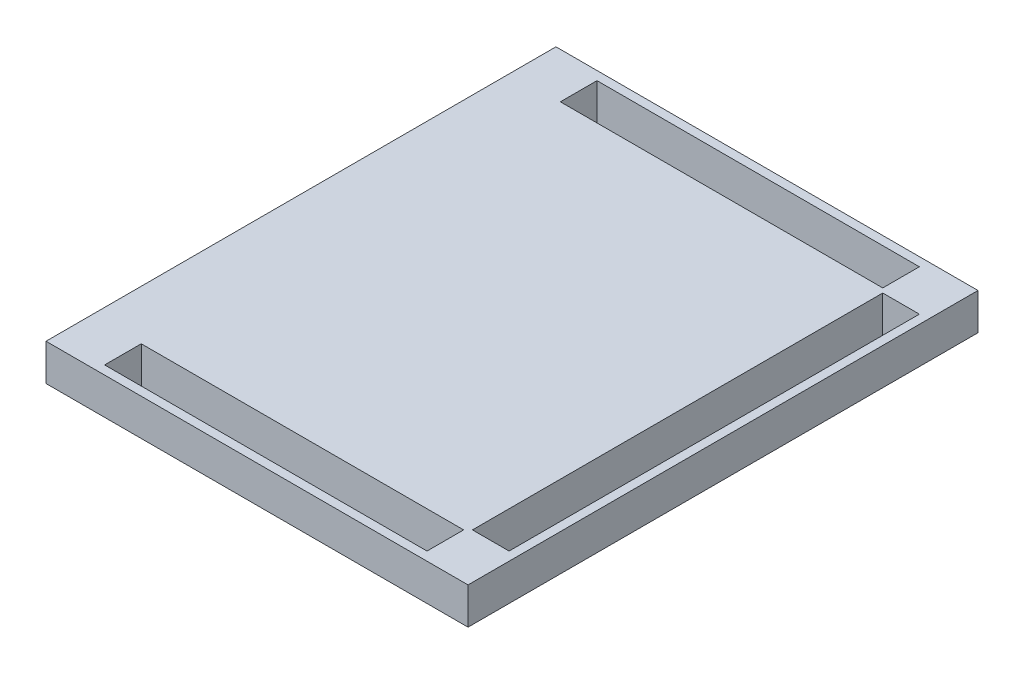
ISO-10303-21;
HEADER;
FILE_DESCRIPTION(('STEP AP214'),'2;1');
FILE_NAME('part.step','',(''),(''),'','','');
FILE_SCHEMA(('AUTOMOTIVE_DESIGN { 1 0 10303 214 1 1 1 1 }'));
ENDSEC;
DATA;
#1=APPLICATION_CONTEXT('core data for automotive mechanical design processes');
#2=APPLICATION_PROTOCOL_DEFINITION('international standard','automotive_design',2000,#1);
#3=PRODUCT_CONTEXT('',#1,'mechanical');
#4=PRODUCT('Part','Part','',(#3));
#5=PRODUCT_RELATED_PRODUCT_CATEGORY('part','',(#4));
#6=PRODUCT_DEFINITION_FORMATION('','',#4);
#7=PRODUCT_DEFINITION_CONTEXT('part definition',#1,'design');
#8=PRODUCT_DEFINITION('design','',#6,#7);
#9=PRODUCT_DEFINITION_SHAPE('','',#8);
#10=(LENGTH_UNIT() NAMED_UNIT(*) SI_UNIT(.MILLI.,.METRE.));
#11=(NAMED_UNIT(*) PLANE_ANGLE_UNIT() SI_UNIT($,.RADIAN.));
#12=(NAMED_UNIT(*) SI_UNIT($,.STERADIAN.) SOLID_ANGLE_UNIT());
#13=UNCERTAINTY_MEASURE_WITH_UNIT(LENGTH_MEASURE(1.E-05),#10,'distance_accuracy_value','');
#14=(GEOMETRIC_REPRESENTATION_CONTEXT(3) GLOBAL_UNCERTAINTY_ASSIGNED_CONTEXT((#13)) GLOBAL_UNIT_ASSIGNED_CONTEXT((#10,
#11,#12)) REPRESENTATION_CONTEXT('',''));
#15=CARTESIAN_POINT('',(0.,0.,0.));
#16=DIRECTION('',(0.,0.,1.));
#17=DIRECTION('',(1.,0.,0.));
#18=AXIS2_PLACEMENT_3D('',#15,#16,#17);
#19=CARTESIAN_POINT('',(0.,25.,0.));
#20=DIRECTION('',(0.,1.,0.));
#21=DIRECTION('',(0.,0.,1.));
#22=AXIS2_PLACEMENT_3D('',#19,#20,#21);
#23=PLANE('',#22);
#24=DIRECTION('',(0.,0.,1.));
#25=VECTOR('',#24,1.);
#26=CARTESIAN_POINT('',(-32.2226938585367,25.,-333.011164946951));
#27=LINE('',#26,#25);
#28=CARTESIAN_POINT('',(-32.2226938585367,25.,-333.011164946951));
#29=VERTEX_POINT('',#28);
#30=CARTESIAN_POINT('',(-32.2226938585366,25.,14.9888350530488));
#31=VERTEX_POINT('',#30);
#32=EDGE_CURVE('E289',#29,#31,#27,.T.);
#33=ORIENTED_EDGE('',*,*,#32,.T.);
#34=DIRECTION('',(1.,0.,0.));
#35=VECTOR('',#34,1.);
#36=CARTESIAN_POINT('',(-32.2226938585366,25.,14.9888350530488));
#37=LINE('',#36,#35);
#38=CARTESIAN_POINT('',(255.777306141463,25.,14.9888350530488));
#39=VERTEX_POINT('',#38);
#40=EDGE_CURVE('E293',#31,#39,#37,.T.);
#41=ORIENTED_EDGE('',*,*,#40,.T.);
#42=DIRECTION('',(0.,0.,-1.));
#43=VECTOR('',#42,1.);
#44=CARTESIAN_POINT('',(255.777306141463,25.,-333.011164946951));
#45=LINE('',#44,#43);
#46=CARTESIAN_POINT('',(255.777306141463,25.,-333.011164946951));
#47=VERTEX_POINT('',#46);
#48=EDGE_CURVE('E297',#39,#47,#45,.T.);
#49=ORIENTED_EDGE('',*,*,#48,.T.);
#50=DIRECTION('',(-1.,0.,0.));
#51=VECTOR('',#50,1.);
#52=CARTESIAN_POINT('',(-32.2226938585367,25.,-333.011164946951));
#53=LINE('',#52,#51);
#54=EDGE_CURVE('E300',#47,#29,#53,.T.);
#55=ORIENTED_EDGE('',*,*,#54,.T.);
#56=EDGE_LOOP('',(#33,#41,#49,#55));
#57=FACE_BOUND('',#56,.T.);
#58=DIRECTION('',(1.,0.,0.));
#59=VECTOR('',#58,1.);
#60=CARTESIAN_POINT('',(224.777306141463,25.,-19.0111649469512));
#61=LINE('',#60,#59);
#62=CARTESIAN_POINT('',(224.777306141463,25.,-19.0111649469512));
#63=VERTEX_POINT('',#62);
#64=CARTESIAN_POINT('',(249.777306141463,25.,-19.0111649469512));
#65=VERTEX_POINT('',#64);
#66=EDGE_CURVE('E250',#63,#65,#61,.T.);
#67=ORIENTED_EDGE('',*,*,#66,.F.);
#68=DIRECTION('',(0.,0.,1.));
#69=VECTOR('',#68,1.);
#70=CARTESIAN_POINT('',(224.777306141463,25.,-299.011164946951));
#71=LINE('',#70,#69);
#72=CARTESIAN_POINT('',(224.777306141463,25.,-299.011164946951));
#73=VERTEX_POINT('',#72);
#74=EDGE_CURVE('E247',#73,#63,#71,.T.);
#75=ORIENTED_EDGE('',*,*,#74,.F.);
#76=DIRECTION('',(-1.,0.,0.));
#77=VECTOR('',#76,1.);
#78=CARTESIAN_POINT('',(224.777306141463,25.,-299.011164946951));
#79=LINE('',#78,#77);
#80=CARTESIAN_POINT('',(249.777306141463,25.,-299.011164946951));
#81=VERTEX_POINT('',#80);
#82=EDGE_CURVE('E258',#81,#73,#79,.T.);
#83=ORIENTED_EDGE('',*,*,#82,.F.);
#84=DIRECTION('',(0.,0.,-1.));
#85=VECTOR('',#84,1.);
#86=CARTESIAN_POINT('',(249.777306141463,25.,-299.011164946951));
#87=LINE('',#86,#85);
#88=EDGE_CURVE('E254',#65,#81,#87,.T.);
#89=ORIENTED_EDGE('',*,*,#88,.F.);
#90=EDGE_LOOP('',(#67,#75,#83,#89));
#91=FACE_BOUND('',#90,.T.);
#92=DIRECTION('',(1.,0.,0.));
#93=VECTOR('',#92,1.);
#94=CARTESIAN_POINT('',(1.77730614146338,25.,8.98883505304879));
#95=LINE('',#94,#93);
#96=CARTESIAN_POINT('',(1.77730614146338,25.,8.98883505304879));
#97=VERTEX_POINT('',#96);
#98=CARTESIAN_POINT('',(221.777306141463,25.,8.98883505304879));
#99=VERTEX_POINT('',#98);
#100=EDGE_CURVE('E209',#97,#99,#95,.T.);
#101=ORIENTED_EDGE('',*,*,#100,.F.);
#102=DIRECTION('',(0.,0.,1.));
#103=VECTOR('',#102,1.);
#104=CARTESIAN_POINT('',(1.77730614146337,25.,-16.0111649469512));
#105=LINE('',#104,#103);
#106=CARTESIAN_POINT('',(1.77730614146337,25.,-16.0111649469512));
#107=VERTEX_POINT('',#106);
#108=EDGE_CURVE('E206',#107,#97,#105,.T.);
#109=ORIENTED_EDGE('',*,*,#108,.F.);
#110=DIRECTION('',(-1.,0.,0.));
#111=VECTOR('',#110,1.);
#112=CARTESIAN_POINT('',(1.77730614146337,25.,-16.0111649469512));
#113=LINE('',#112,#111);
#114=CARTESIAN_POINT('',(221.777306141463,25.,-16.0111649469512));
#115=VERTEX_POINT('',#114);
#116=EDGE_CURVE('E216',#115,#107,#113,.T.);
#117=ORIENTED_EDGE('',*,*,#116,.F.);
#118=DIRECTION('',(0.,0.,-1.));
#119=VECTOR('',#118,1.);
#120=CARTESIAN_POINT('',(221.777306141463,25.,-16.0111649469512));
#121=LINE('',#120,#119);
#122=EDGE_CURVE('E213',#99,#115,#121,.T.);
#123=ORIENTED_EDGE('',*,*,#122,.F.);
#124=EDGE_LOOP('',(#101,#109,#117,#123));
#125=FACE_BOUND('',#124,.T.);
#126=DIRECTION('',(1.,0.,0.));
#127=VECTOR('',#126,1.);
#128=CARTESIAN_POINT('',(1.77730614146338,25.,-302.011164946951));
#129=LINE('',#128,#127);
#130=CARTESIAN_POINT('',(1.77730614146338,25.,-302.011164946951));
#131=VERTEX_POINT('',#130);
#132=CARTESIAN_POINT('',(221.777306141463,25.,-302.011164946951));
#133=VERTEX_POINT('',#132);
#134=EDGE_CURVE('E165',#131,#133,#129,.T.);
#135=ORIENTED_EDGE('',*,*,#134,.F.);
#136=DIRECTION('',(0.,0.,1.));
#137=VECTOR('',#136,1.);
#138=CARTESIAN_POINT('',(1.77730614146338,25.,-327.011164946951));
#139=LINE('',#138,#137);
#140=CARTESIAN_POINT('',(1.77730614146338,25.,-327.011164946951));
#141=VERTEX_POINT('',#140);
#142=EDGE_CURVE('E154',#141,#131,#139,.T.);
#143=ORIENTED_EDGE('',*,*,#142,.F.);
#144=DIRECTION('',(-1.,0.,0.));
#145=VECTOR('',#144,1.);
#146=CARTESIAN_POINT('',(1.77730614146338,25.,-327.011164946951));
#147=LINE('',#146,#145);
#148=CARTESIAN_POINT('',(221.777306141463,25.,-327.011164946951));
#149=VERTEX_POINT('',#148);
#150=EDGE_CURVE('E182',#149,#141,#147,.T.);
#151=ORIENTED_EDGE('',*,*,#150,.F.);
#152=DIRECTION('',(0.,0.,-1.));
#153=VECTOR('',#152,1.);
#154=CARTESIAN_POINT('',(221.777306141463,25.,-327.011164946951));
#155=LINE('',#154,#153);
#156=EDGE_CURVE('E178',#133,#149,#155,.T.);
#157=ORIENTED_EDGE('',*,*,#156,.F.);
#158=EDGE_LOOP('',(#135,#143,#151,#157));
#159=FACE_BOUND('',#158,.T.);
#160=ADVANCED_FACE('F39',(#57,#91,#125,#159),#23,.T.);
#161=CARTESIAN_POINT('',(0.,0.,0.));
#162=DIRECTION('',(0.,1.,0.));
#163=DIRECTION('',(0.,0.,1.));
#164=AXIS2_PLACEMENT_3D('',#161,#162,#163);
#165=PLANE('',#164);
#166=DIRECTION('',(0.,0.,1.));
#167=VECTOR('',#166,1.);
#168=CARTESIAN_POINT('',(1.77730614146337,0.,-16.0111649469512));
#169=LINE('',#168,#167);
#170=CARTESIAN_POINT('',(1.77730614146337,0.,-16.0111649469512));
#171=VERTEX_POINT('',#170);
#172=CARTESIAN_POINT('',(1.77730614146338,0.,8.98883505304879));
#173=VERTEX_POINT('',#172);
#174=EDGE_CURVE('E220',#171,#173,#169,.T.);
#175=ORIENTED_EDGE('',*,*,#174,.T.);
#176=DIRECTION('',(1.,0.,0.));
#177=VECTOR('',#176,1.);
#178=CARTESIAN_POINT('',(1.77730614146338,0.,8.98883505304879));
#179=LINE('',#178,#177);
#180=CARTESIAN_POINT('',(221.777306141463,0.,8.98883505304879));
#181=VERTEX_POINT('',#180);
#182=EDGE_CURVE('E224',#173,#181,#179,.T.);
#183=ORIENTED_EDGE('',*,*,#182,.T.);
#184=DIRECTION('',(0.,0.,-1.));
#185=VECTOR('',#184,1.);
#186=CARTESIAN_POINT('',(221.777306141463,0.,-16.0111649469512));
#187=LINE('',#186,#185);
#188=CARTESIAN_POINT('',(221.777306141463,0.,-16.0111649469512));
#189=VERTEX_POINT('',#188);
#190=EDGE_CURVE('E229',#181,#189,#187,.T.);
#191=ORIENTED_EDGE('',*,*,#190,.T.);
#192=DIRECTION('',(-1.,0.,0.));
#193=VECTOR('',#192,1.);
#194=CARTESIAN_POINT('',(1.77730614146337,0.,-16.0111649469512));
#195=LINE('',#194,#193);
#196=EDGE_CURVE('E210',#189,#171,#195,.T.);
#197=ORIENTED_EDGE('',*,*,#196,.T.);
#198=EDGE_LOOP('',(#175,#183,#191,#197));
#199=FACE_BOUND('',#198,.T.);
#200=DIRECTION('',(0.,0.,1.));
#201=VECTOR('',#200,1.);
#202=CARTESIAN_POINT('',(-32.2226938585367,0.,-333.011164946951));
#203=LINE('',#202,#201);
#204=CARTESIAN_POINT('',(-32.2226938585367,0.,-333.011164946951));
#205=VERTEX_POINT('',#204);
#206=CARTESIAN_POINT('',(-32.2226938585366,0.,14.9888350530488));
#207=VERTEX_POINT('',#206);
#208=EDGE_CURVE('E174',#205,#207,#203,.T.);
#209=ORIENTED_EDGE('',*,*,#208,.F.);
#210=DIRECTION('',(-1.,0.,0.));
#211=VECTOR('',#210,1.);
#212=CARTESIAN_POINT('',(-32.2226938585367,0.,-333.011164946951));
#213=LINE('',#212,#211);
#214=CARTESIAN_POINT('',(255.777306141463,0.,-333.011164946951));
#215=VERTEX_POINT('',#214);
#216=EDGE_CURVE('E294',#215,#205,#213,.T.);
#217=ORIENTED_EDGE('',*,*,#216,.F.);
#218=DIRECTION('',(0.,0.,-1.));
#219=VECTOR('',#218,1.);
#220=CARTESIAN_POINT('',(255.777306141463,0.,-333.011164946951));
#221=LINE('',#220,#219);
#222=CARTESIAN_POINT('',(255.777306141463,0.,14.9888350530488));
#223=VERTEX_POINT('',#222);
#224=EDGE_CURVE('E310',#223,#215,#221,.T.);
#225=ORIENTED_EDGE('',*,*,#224,.F.);
#226=DIRECTION('',(1.,0.,0.));
#227=VECTOR('',#226,1.);
#228=CARTESIAN_POINT('',(-32.2226938585366,0.,14.9888350530488));
#229=LINE('',#228,#227);
#230=EDGE_CURVE('E307',#207,#223,#229,.T.);
#231=ORIENTED_EDGE('',*,*,#230,.F.);
#232=EDGE_LOOP('',(#209,#217,#225,#231));
#233=FACE_BOUND('',#232,.T.);
#234=DIRECTION('',(0.,0.,1.));
#235=VECTOR('',#234,1.);
#236=CARTESIAN_POINT('',(224.777306141463,0.,-299.011164946951));
#237=LINE('',#236,#235);
#238=CARTESIAN_POINT('',(224.777306141463,0.,-299.011164946951));
#239=VERTEX_POINT('',#238);
#240=CARTESIAN_POINT('',(224.777306141463,0.,-19.0111649469512));
#241=VERTEX_POINT('',#240);
#242=EDGE_CURVE('E262',#239,#241,#237,.T.);
#243=ORIENTED_EDGE('',*,*,#242,.T.);
#244=DIRECTION('',(1.,0.,0.));
#245=VECTOR('',#244,1.);
#246=CARTESIAN_POINT('',(224.777306141463,0.,-19.0111649469512));
#247=LINE('',#246,#245);
#248=CARTESIAN_POINT('',(249.777306141463,0.,-19.0111649469512));
#249=VERTEX_POINT('',#248);
#250=EDGE_CURVE('E266',#241,#249,#247,.T.);
#251=ORIENTED_EDGE('',*,*,#250,.T.);
#252=DIRECTION('',(0.,0.,-1.));
#253=VECTOR('',#252,1.);
#254=CARTESIAN_POINT('',(249.777306141463,0.,-299.011164946951));
#255=LINE('',#254,#253);
#256=CARTESIAN_POINT('',(249.777306141463,0.,-299.011164946951));
#257=VERTEX_POINT('',#256);
#258=EDGE_CURVE('E270',#249,#257,#255,.T.);
#259=ORIENTED_EDGE('',*,*,#258,.T.);
#260=DIRECTION('',(-1.,0.,0.));
#261=VECTOR('',#260,1.);
#262=CARTESIAN_POINT('',(224.777306141463,0.,-299.011164946951));
#263=LINE('',#262,#261);
#264=EDGE_CURVE('E251',#257,#239,#263,.T.);
#265=ORIENTED_EDGE('',*,*,#264,.T.);
#266=EDGE_LOOP('',(#243,#251,#259,#265));
#267=FACE_BOUND('',#266,.T.);
#268=DIRECTION('',(0.,0.,1.));
#269=VECTOR('',#268,1.);
#270=CARTESIAN_POINT('',(1.77730614146338,0.,-327.011164946951));
#271=LINE('',#270,#269);
#272=CARTESIAN_POINT('',(1.77730614146338,0.,-327.011164946951));
#273=VERTEX_POINT('',#272);
#274=CARTESIAN_POINT('',(1.77730614146338,0.,-302.011164946951));
#275=VERTEX_POINT('',#274);
#276=EDGE_CURVE('E187',#273,#275,#271,.T.);
#277=ORIENTED_EDGE('',*,*,#276,.T.);
#278=DIRECTION('',(1.,0.,0.));
#279=VECTOR('',#278,1.);
#280=CARTESIAN_POINT('',(1.77730614146338,0.,-302.011164946951));
#281=LINE('',#280,#279);
#282=CARTESIAN_POINT('',(221.777306141463,0.,-302.011164946951));
#283=VERTEX_POINT('',#282);
#284=EDGE_CURVE('E172',#275,#283,#281,.T.);
#285=ORIENTED_EDGE('',*,*,#284,.T.);
#286=DIRECTION('',(0.,0.,-1.));
#287=VECTOR('',#286,1.);
#288=CARTESIAN_POINT('',(221.777306141463,0.,-327.011164946951));
#289=LINE('',#288,#287);
#290=CARTESIAN_POINT('',(221.777306141463,0.,-327.011164946951));
#291=VERTEX_POINT('',#290);
#292=EDGE_CURVE('E193',#283,#291,#289,.T.);
#293=ORIENTED_EDGE('',*,*,#292,.T.);
#294=DIRECTION('',(-1.,0.,0.));
#295=VECTOR('',#294,1.);
#296=CARTESIAN_POINT('',(1.77730614146338,0.,-327.011164946951));
#297=LINE('',#296,#295);
#298=EDGE_CURVE('E166',#291,#273,#297,.T.);
#299=ORIENTED_EDGE('',*,*,#298,.T.);
#300=EDGE_LOOP('',(#277,#285,#293,#299));
#301=FACE_BOUND('',#300,.T.);
#302=ADVANCED_FACE('F333',(#199,#233,#267,#301),#165,.F.);
#303=CARTESIAN_POINT('',(-32.2226938585367,25.,-333.011164946951));
#304=DIRECTION('',(1.,0.,0.));
#305=DIRECTION('',(0.,0.,-1.));
#306=AXIS2_PLACEMENT_3D('',#303,#304,#305);
#307=PLANE('',#306);
#308=ORIENTED_EDGE('',*,*,#208,.T.);
#309=DIRECTION('',(0.,-1.,0.));
#310=VECTOR('',#309,1.);
#311=CARTESIAN_POINT('',(-32.2226938585366,25.,14.9888350530488));
#312=LINE('',#311,#310);
#313=EDGE_CURVE('E11',#31,#207,#312,.T.);
#314=ORIENTED_EDGE('',*,*,#313,.F.);
#315=ORIENTED_EDGE('',*,*,#32,.F.);
#316=DIRECTION('',(0.,-1.,0.));
#317=VECTOR('',#316,1.);
#318=CARTESIAN_POINT('',(-32.2226938585367,25.,-333.011164946951));
#319=LINE('',#318,#317);
#320=EDGE_CURVE('E303',#29,#205,#319,.T.);
#321=ORIENTED_EDGE('',*,*,#320,.T.);
#322=EDGE_LOOP('',(#308,#314,#315,#321));
#323=FACE_BOUND('',#322,.T.);
#324=ADVANCED_FACE('F41',(#323),#307,.F.);
#325=CARTESIAN_POINT('',(-32.2226938585366,25.,14.9888350530488));
#326=DIRECTION('',(0.,0.,-1.));
#327=DIRECTION('',(-1.,0.,0.));
#328=AXIS2_PLACEMENT_3D('',#325,#326,#327);
#329=PLANE('',#328);
#330=ORIENTED_EDGE('',*,*,#230,.T.);
#331=DIRECTION('',(0.,-1.,0.));
#332=VECTOR('',#331,1.);
#333=CARTESIAN_POINT('',(255.777306141463,25.,14.9888350530488));
#334=LINE('',#333,#332);
#335=EDGE_CURVE('E48',#39,#223,#334,.T.);
#336=ORIENTED_EDGE('',*,*,#335,.F.);
#337=ORIENTED_EDGE('',*,*,#40,.F.);
#338=ORIENTED_EDGE('',*,*,#313,.T.);
#339=EDGE_LOOP('',(#330,#336,#337,#338));
#340=FACE_BOUND('',#339,.T.);
#341=ADVANCED_FACE('F344',(#340),#329,.F.);
#342=CARTESIAN_POINT('',(255.777306141463,25.,-333.011164946951));
#343=DIRECTION('',(-1.,0.,0.));
#344=DIRECTION('',(0.,0.,1.));
#345=AXIS2_PLACEMENT_3D('',#342,#343,#344);
#346=PLANE('',#345);
#347=ORIENTED_EDGE('',*,*,#224,.T.);
#348=DIRECTION('',(0.,-1.,0.));
#349=VECTOR('',#348,1.);
#350=CARTESIAN_POINT('',(255.777306141463,25.,-333.011164946951));
#351=LINE('',#350,#349);
#352=EDGE_CURVE('E318',#47,#215,#351,.T.);
#353=ORIENTED_EDGE('',*,*,#352,.F.);
#354=ORIENTED_EDGE('',*,*,#48,.F.);
#355=ORIENTED_EDGE('',*,*,#335,.T.);
#356=EDGE_LOOP('',(#347,#353,#354,#355));
#357=FACE_BOUND('',#356,.T.);
#358=ADVANCED_FACE('F327',(#357),#346,.F.);
#359=CARTESIAN_POINT('',(-32.2226938585367,25.,-333.011164946951));
#360=DIRECTION('',(0.,0.,1.));
#361=DIRECTION('',(1.,0.,0.));
#362=AXIS2_PLACEMENT_3D('',#359,#360,#361);
#363=PLANE('',#362);
#364=ORIENTED_EDGE('',*,*,#216,.T.);
#365=ORIENTED_EDGE('',*,*,#320,.F.);
#366=ORIENTED_EDGE('',*,*,#54,.F.);
#367=ORIENTED_EDGE('',*,*,#352,.T.);
#368=EDGE_LOOP('',(#364,#365,#366,#367));
#369=FACE_BOUND('',#368,.T.);
#370=ADVANCED_FACE('F337',(#369),#363,.F.);
#371=CARTESIAN_POINT('',(224.777306141463,25.,-299.011164946951));
#372=DIRECTION('',(1.,0.,0.));
#373=DIRECTION('',(0.,0.,-1.));
#374=AXIS2_PLACEMENT_3D('',#371,#372,#373);
#375=PLANE('',#374);
#376=ORIENTED_EDGE('',*,*,#242,.F.);
#377=DIRECTION('',(0.,-1.,0.));
#378=VECTOR('',#377,1.);
#379=CARTESIAN_POINT('',(224.777306141463,25.,-299.011164946951));
#380=LINE('',#379,#378);
#381=EDGE_CURVE('E261',#73,#239,#380,.T.);
#382=ORIENTED_EDGE('',*,*,#381,.F.);
#383=ORIENTED_EDGE('',*,*,#74,.T.);
#384=DIRECTION('',(0.,-1.,0.));
#385=VECTOR('',#384,1.);
#386=CARTESIAN_POINT('',(224.777306141463,25.,-19.0111649469512));
#387=LINE('',#386,#385);
#388=EDGE_CURVE('E225',#63,#241,#387,.T.);
#389=ORIENTED_EDGE('',*,*,#388,.T.);
#390=EDGE_LOOP('',(#376,#382,#383,#389));
#391=FACE_BOUND('',#390,.T.);
#392=ADVANCED_FACE('F359',(#391),#375,.T.);
#393=CARTESIAN_POINT('',(224.777306141463,25.,-19.0111649469512));
#394=DIRECTION('',(0.,0.,-1.));
#395=DIRECTION('',(-1.,0.,0.));
#396=AXIS2_PLACEMENT_3D('',#393,#394,#395);
#397=PLANE('',#396);
#398=ORIENTED_EDGE('',*,*,#250,.F.);
#399=ORIENTED_EDGE('',*,*,#388,.F.);
#400=ORIENTED_EDGE('',*,*,#66,.T.);
#401=DIRECTION('',(0.,-1.,0.));
#402=VECTOR('',#401,1.);
#403=CARTESIAN_POINT('',(249.777306141463,25.,-19.0111649469512));
#404=LINE('',#403,#402);
#405=EDGE_CURVE('E283',#65,#249,#404,.T.);
#406=ORIENTED_EDGE('',*,*,#405,.T.);
#407=EDGE_LOOP('',(#398,#399,#400,#406));
#408=FACE_BOUND('',#407,.T.);
#409=ADVANCED_FACE('F366',(#408),#397,.T.);
#410=CARTESIAN_POINT('',(249.777306141463,25.,-299.011164946951));
#411=DIRECTION('',(-1.,0.,0.));
#412=DIRECTION('',(0.,0.,1.));
#413=AXIS2_PLACEMENT_3D('',#410,#411,#412);
#414=PLANE('',#413);
#415=ORIENTED_EDGE('',*,*,#258,.F.);
#416=ORIENTED_EDGE('',*,*,#405,.F.);
#417=ORIENTED_EDGE('',*,*,#88,.T.);
#418=DIRECTION('',(0.,-1.,0.));
#419=VECTOR('',#418,1.);
#420=CARTESIAN_POINT('',(249.777306141463,25.,-299.011164946951));
#421=LINE('',#420,#419);
#422=EDGE_CURVE('E280',#81,#257,#421,.T.);
#423=ORIENTED_EDGE('',*,*,#422,.T.);
#424=EDGE_LOOP('',(#415,#416,#417,#423));
#425=FACE_BOUND('',#424,.T.);
#426=ADVANCED_FACE('F371',(#425),#414,.T.);
#427=CARTESIAN_POINT('',(224.777306141463,25.,-299.011164946951));
#428=DIRECTION('',(0.,0.,1.));
#429=DIRECTION('',(1.,0.,0.));
#430=AXIS2_PLACEMENT_3D('',#427,#428,#429);
#431=PLANE('',#430);
#432=ORIENTED_EDGE('',*,*,#264,.F.);
#433=ORIENTED_EDGE('',*,*,#422,.F.);
#434=ORIENTED_EDGE('',*,*,#82,.T.);
#435=ORIENTED_EDGE('',*,*,#381,.T.);
#436=EDGE_LOOP('',(#432,#433,#434,#435));
#437=FACE_BOUND('',#436,.T.);
#438=ADVANCED_FACE('F378',(#437),#431,.T.);
#439=CARTESIAN_POINT('',(1.77730614146337,25.,-16.0111649469512));
#440=DIRECTION('',(1.,0.,0.));
#441=DIRECTION('',(0.,0.,-1.));
#442=AXIS2_PLACEMENT_3D('',#439,#440,#441);
#443=PLANE('',#442);
#444=ORIENTED_EDGE('',*,*,#174,.F.);
#445=DIRECTION('',(0.,-1.,0.));
#446=VECTOR('',#445,1.);
#447=CARTESIAN_POINT('',(1.77730614146337,25.,-16.0111649469512));
#448=LINE('',#447,#446);
#449=EDGE_CURVE('E219',#107,#171,#448,.T.);
#450=ORIENTED_EDGE('',*,*,#449,.F.);
#451=ORIENTED_EDGE('',*,*,#108,.T.);
#452=DIRECTION('',(0.,-1.,0.));
#453=VECTOR('',#452,1.);
#454=CARTESIAN_POINT('',(1.77730614146338,25.,8.98883505304879));
#455=LINE('',#454,#453);
#456=EDGE_CURVE('E190',#97,#173,#455,.T.);
#457=ORIENTED_EDGE('',*,*,#456,.T.);
#458=EDGE_LOOP('',(#444,#450,#451,#457));
#459=FACE_BOUND('',#458,.T.);
#460=ADVANCED_FACE('F399',(#459),#443,.T.);
#461=CARTESIAN_POINT('',(1.77730614146338,25.,8.98883505304879));
#462=DIRECTION('',(0.,0.,-1.));
#463=DIRECTION('',(-1.,0.,0.));
#464=AXIS2_PLACEMENT_3D('',#461,#462,#463);
#465=PLANE('',#464);
#466=ORIENTED_EDGE('',*,*,#182,.F.);
#467=ORIENTED_EDGE('',*,*,#456,.F.);
#468=ORIENTED_EDGE('',*,*,#100,.T.);
#469=DIRECTION('',(0.,-1.,0.));
#470=VECTOR('',#469,1.);
#471=CARTESIAN_POINT('',(221.777306141463,25.,8.98883505304879));
#472=LINE('',#471,#470);
#473=EDGE_CURVE('E241',#99,#181,#472,.T.);
#474=ORIENTED_EDGE('',*,*,#473,.T.);
#475=EDGE_LOOP('',(#466,#467,#468,#474));
#476=FACE_BOUND('',#475,.T.);
#477=ADVANCED_FACE('F394',(#476),#465,.T.);
#478=CARTESIAN_POINT('',(221.777306141463,25.,-16.0111649469512));
#479=DIRECTION('',(-1.,0.,0.));
#480=DIRECTION('',(0.,0.,1.));
#481=AXIS2_PLACEMENT_3D('',#478,#479,#480);
#482=PLANE('',#481);
#483=ORIENTED_EDGE('',*,*,#190,.F.);
#484=ORIENTED_EDGE('',*,*,#473,.F.);
#485=ORIENTED_EDGE('',*,*,#122,.T.);
#486=DIRECTION('',(0.,-1.,0.));
#487=VECTOR('',#486,1.);
#488=CARTESIAN_POINT('',(221.777306141463,25.,-16.0111649469512));
#489=LINE('',#488,#487);
#490=EDGE_CURVE('E63',#115,#189,#489,.T.);
#491=ORIENTED_EDGE('',*,*,#490,.T.);
#492=EDGE_LOOP('',(#483,#484,#485,#491));
#493=FACE_BOUND('',#492,.T.);
#494=ADVANCED_FACE('F397',(#493),#482,.T.);
#495=CARTESIAN_POINT('',(1.77730614146337,25.,-16.0111649469512));
#496=DIRECTION('',(0.,0.,1.));
#497=DIRECTION('',(1.,0.,0.));
#498=AXIS2_PLACEMENT_3D('',#495,#496,#497);
#499=PLANE('',#498);
#500=ORIENTED_EDGE('',*,*,#196,.F.);
#501=ORIENTED_EDGE('',*,*,#490,.F.);
#502=ORIENTED_EDGE('',*,*,#116,.T.);
#503=ORIENTED_EDGE('',*,*,#449,.T.);
#504=EDGE_LOOP('',(#500,#501,#502,#503));
#505=FACE_BOUND('',#504,.T.);
#506=ADVANCED_FACE('F401',(#505),#499,.T.);
#507=CARTESIAN_POINT('',(1.77730614146338,25.,-327.011164946951));
#508=DIRECTION('',(1.,0.,0.));
#509=DIRECTION('',(0.,0.,-1.));
#510=AXIS2_PLACEMENT_3D('',#507,#508,#509);
#511=PLANE('',#510);
#512=ORIENTED_EDGE('',*,*,#276,.F.);
#513=DIRECTION('',(0.,-1.,0.));
#514=VECTOR('',#513,1.);
#515=CARTESIAN_POINT('',(1.77730614146338,25.,-327.011164946951));
#516=LINE('',#515,#514);
#517=EDGE_CURVE('E160',#141,#273,#516,.T.);
#518=ORIENTED_EDGE('',*,*,#517,.F.);
#519=ORIENTED_EDGE('',*,*,#142,.T.);
#520=DIRECTION('',(0.,-1.,0.));
#521=VECTOR('',#520,1.);
#522=CARTESIAN_POINT('',(1.77730614146338,25.,-302.011164946951));
#523=LINE('',#522,#521);
#524=EDGE_CURVE('E157',#131,#275,#523,.T.);
#525=ORIENTED_EDGE('',*,*,#524,.T.);
#526=EDGE_LOOP('',(#512,#518,#519,#525));
#527=FACE_BOUND('',#526,.T.);
#528=ADVANCED_FACE('F156',(#527),#511,.T.);
#529=CARTESIAN_POINT('',(1.77730614146338,25.,-302.011164946951));
#530=DIRECTION('',(0.,0.,-1.));
#531=DIRECTION('',(-1.,0.,0.));
#532=AXIS2_PLACEMENT_3D('',#529,#530,#531);
#533=PLANE('',#532);
#534=ORIENTED_EDGE('',*,*,#284,.F.);
#535=ORIENTED_EDGE('',*,*,#524,.F.);
#536=ORIENTED_EDGE('',*,*,#134,.T.);
#537=DIRECTION('',(0.,-1.,0.));
#538=VECTOR('',#537,1.);
#539=CARTESIAN_POINT('',(221.777306141463,25.,-302.011164946951));
#540=LINE('',#539,#538);
#541=EDGE_CURVE('E175',#133,#283,#540,.T.);
#542=ORIENTED_EDGE('',*,*,#541,.T.);
#543=EDGE_LOOP('',(#534,#535,#536,#542));
#544=FACE_BOUND('',#543,.T.);
#545=ADVANCED_FACE('F169',(#544),#533,.T.);
#546=CARTESIAN_POINT('',(221.777306141463,25.,-327.011164946951));
#547=DIRECTION('',(-1.,0.,0.));
#548=DIRECTION('',(0.,0.,1.));
#549=AXIS2_PLACEMENT_3D('',#546,#547,#548);
#550=PLANE('',#549);
#551=ORIENTED_EDGE('',*,*,#292,.F.);
#552=ORIENTED_EDGE('',*,*,#541,.F.);
#553=ORIENTED_EDGE('',*,*,#156,.T.);
#554=DIRECTION('',(0.,-1.,0.));
#555=VECTOR('',#554,1.);
#556=CARTESIAN_POINT('',(221.777306141463,25.,-327.011164946951));
#557=LINE('',#556,#555);
#558=EDGE_CURVE('E55',#149,#291,#557,.T.);
#559=ORIENTED_EDGE('',*,*,#558,.T.);
#560=EDGE_LOOP('',(#551,#552,#553,#559));
#561=FACE_BOUND('',#560,.T.);
#562=ADVANCED_FACE('F458',(#561),#550,.T.);
#563=CARTESIAN_POINT('',(1.77730614146338,25.,-327.011164946951));
#564=DIRECTION('',(0.,0.,1.));
#565=DIRECTION('',(1.,0.,0.));
#566=AXIS2_PLACEMENT_3D('',#563,#564,#565);
#567=PLANE('',#566);
#568=ORIENTED_EDGE('',*,*,#298,.F.);
#569=ORIENTED_EDGE('',*,*,#558,.F.);
#570=ORIENTED_EDGE('',*,*,#150,.T.);
#571=ORIENTED_EDGE('',*,*,#517,.T.);
#572=EDGE_LOOP('',(#568,#569,#570,#571));
#573=FACE_BOUND('',#572,.T.);
#574=ADVANCED_FACE('F466',(#573),#567,.T.);
#575=CLOSED_SHELL('',(#160,#302,#324,#341,#358,#370,#392,#409,#426,#438,#460,#477,#494,#506,
#528,#545,#562,#574));
#576=MANIFOLD_SOLID_BREP('B2',#575);
#577=ADVANCED_BREP_SHAPE_REPRESENTATION('',(#18,#576),#14);
#578=SHAPE_DEFINITION_REPRESENTATION(#9,#577);
ENDSEC;
END-ISO-10303-21;
